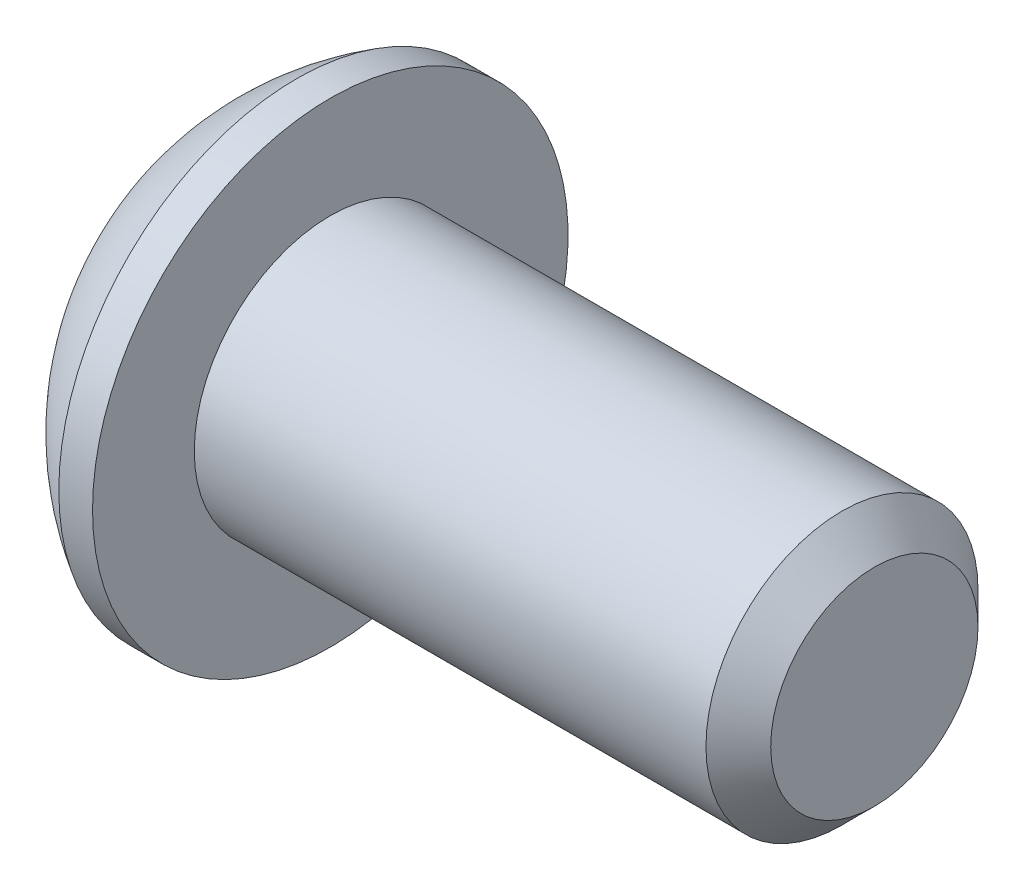
ISO-10303-21;
HEADER;
FILE_DESCRIPTION(('STEP AP214'),'2;1');
FILE_NAME('part.step','',(''),(''),'','','');
FILE_SCHEMA(('AUTOMOTIVE_DESIGN { 1 0 10303 214 1 1 1 1 }'));
ENDSEC;
DATA;
#1=APPLICATION_CONTEXT('core data for automotive mechanical design processes');
#2=APPLICATION_PROTOCOL_DEFINITION('international standard','automotive_design',2000,#1);
#3=PRODUCT_CONTEXT('',#1,'mechanical');
#4=PRODUCT('Part','Part','',(#3));
#5=PRODUCT_RELATED_PRODUCT_CATEGORY('part','',(#4));
#6=PRODUCT_DEFINITION_FORMATION('','',#4);
#7=PRODUCT_DEFINITION_CONTEXT('part definition',#1,'design');
#8=PRODUCT_DEFINITION('design','',#6,#7);
#9=PRODUCT_DEFINITION_SHAPE('','',#8);
#10=(LENGTH_UNIT() NAMED_UNIT(*) SI_UNIT(.MILLI.,.METRE.));
#11=(NAMED_UNIT(*) PLANE_ANGLE_UNIT() SI_UNIT($,.RADIAN.));
#12=(NAMED_UNIT(*) SI_UNIT($,.STERADIAN.) SOLID_ANGLE_UNIT());
#13=UNCERTAINTY_MEASURE_WITH_UNIT(LENGTH_MEASURE(1.E-05),#10,'distance_accuracy_value','');
#14=(GEOMETRIC_REPRESENTATION_CONTEXT(3) GLOBAL_UNCERTAINTY_ASSIGNED_CONTEXT((#13)) GLOBAL_UNIT_ASSIGNED_CONTEXT((#10,
#11,#12)) REPRESENTATION_CONTEXT('',''));
#15=CARTESIAN_POINT('',(0.,0.,0.));
#16=DIRECTION('',(0.,0.,1.));
#17=DIRECTION('',(1.,0.,0.));
#18=AXIS2_PLACEMENT_3D('',#15,#16,#17);
#19=CARTESIAN_POINT('',(0.,0.,0.));
#20=DIRECTION('',(-1.,0.,0.));
#21=DIRECTION('',(0.,0.,1.));
#22=AXIS2_PLACEMENT_3D('',#19,#20,#21);
#23=PLANE('',#22);
#24=CARTESIAN_POINT('',(0.,0.,0.));
#25=DIRECTION('',(-1.,0.,0.));
#26=DIRECTION('',(0.,0.,1.));
#27=AXIS2_PLACEMENT_3D('',#24,#25,#26);
#28=CIRCLE('',#27,2.77495);
#29=CARTESIAN_POINT('',(0.,0.,2.77495));
#30=VERTEX_POINT('',#29);
#31=EDGE_CURVE('E11',#30,#30,#28,.T.);
#32=ORIENTED_EDGE('',*,*,#31,.T.);
#33=EDGE_LOOP('',(#32));
#34=FACE_BOUND('',#33,.T.);
#35=DIRECTION('',(0.,-1.,0.));
#36=VECTOR('',#35,1.);
#37=CARTESIAN_POINT('',(0.,-1.14384635331848,1.9812));
#38=LINE('',#37,#36);
#39=CARTESIAN_POINT('',(0.,1.14384635331849,1.9812));
#40=VERTEX_POINT('',#39);
#41=CARTESIAN_POINT('',(0.,-1.14384635331848,1.9812));
#42=VERTEX_POINT('',#41);
#43=EDGE_CURVE('E48',#40,#42,#38,.T.);
#44=ORIENTED_EDGE('',*,*,#43,.T.);
#45=DIRECTION('',(0.,-0.5,-0.866025403784439));
#46=VECTOR('',#45,1.);
#47=CARTESIAN_POINT('',(0.,-2.28769270663697,0.));
#48=LINE('',#47,#46);
#49=CARTESIAN_POINT('',(0.,-2.28769270663697,0.));
#50=VERTEX_POINT('',#49);
#51=EDGE_CURVE('E105',#42,#50,#48,.T.);
#52=ORIENTED_EDGE('',*,*,#51,.T.);
#53=DIRECTION('',(0.,0.5,-0.866025403784439));
#54=VECTOR('',#53,1.);
#55=CARTESIAN_POINT('',(0.,-1.14384635331848,-1.9812));
#56=LINE('',#55,#54);
#57=CARTESIAN_POINT('',(0.,-1.14384635331848,-1.9812));
#58=VERTEX_POINT('',#57);
#59=EDGE_CURVE('E107',#50,#58,#56,.T.);
#60=ORIENTED_EDGE('',*,*,#59,.T.);
#61=DIRECTION('',(0.,1.,0.));
#62=VECTOR('',#61,1.);
#63=CARTESIAN_POINT('',(0.,1.14384635331849,-1.9812));
#64=LINE('',#63,#62);
#65=CARTESIAN_POINT('',(0.,1.14384635331849,-1.9812));
#66=VERTEX_POINT('',#65);
#67=EDGE_CURVE('E122',#58,#66,#64,.T.);
#68=ORIENTED_EDGE('',*,*,#67,.T.);
#69=DIRECTION('',(0.,0.5,0.866025403784439));
#70=VECTOR('',#69,1.);
#71=CARTESIAN_POINT('',(0.,2.28769270663697,0.));
#72=LINE('',#71,#70);
#73=CARTESIAN_POINT('',(0.,2.28769270663697,0.));
#74=VERTEX_POINT('',#73);
#75=EDGE_CURVE('E381',#66,#74,#72,.T.);
#76=ORIENTED_EDGE('',*,*,#75,.T.);
#77=DIRECTION('',(0.,-0.5,0.866025403784439));
#78=VECTOR('',#77,1.);
#79=CARTESIAN_POINT('',(0.,1.14384635331849,1.9812));
#80=LINE('',#79,#78);
#81=EDGE_CURVE('E382',#74,#40,#80,.T.);
#82=ORIENTED_EDGE('',*,*,#81,.T.);
#83=EDGE_LOOP('',(#44,#52,#60,#68,#76,#82));
#84=FACE_BOUND('',#83,.T.);
#85=ADVANCED_FACE('F34',(#34,#84),#23,.T.);
#86=CARTESIAN_POINT('',(5.78512506188119,0.,0.));
#87=DIRECTION('',(-1.,0.,0.));
#88=DIRECTION('',(0.,1.,0.));
#89=AXIS2_PLACEMENT_3D('',#86,#87,#88);
#90=SPHERICAL_SURFACE('',#89,6.41623094067739);
#91=CARTESIAN_POINT('',(2.5654,0.,0.));
#92=DIRECTION('',(-1.,0.,0.));
#93=DIRECTION('',(0.,0.,1.));
#94=AXIS2_PLACEMENT_3D('',#91,#92,#93);
#95=CIRCLE('',#94,5.5499);
#96=CARTESIAN_POINT('',(2.5654,0.,5.5499));
#97=VERTEX_POINT('',#96);
#98=EDGE_CURVE('E41',#97,#97,#95,.T.);
#99=ORIENTED_EDGE('',*,*,#98,.T.);
#100=EDGE_LOOP('',(#99));
#101=FACE_BOUND('',#100,.T.);
#102=ORIENTED_EDGE('',*,*,#31,.F.);
#103=EDGE_LOOP('',(#102));
#104=FACE_BOUND('',#103,.T.);
#105=ADVANCED_FACE('F155',(#101,#104),#90,.T.);
#106=CARTESIAN_POINT('',(0.,0.,0.));
#107=DIRECTION('',(-1.,0.,0.));
#108=DIRECTION('',(0.,0.,1.));
#109=AXIS2_PLACEMENT_3D('',#106,#107,#108);
#110=CYLINDRICAL_SURFACE('',#109,5.5499);
#111=ORIENTED_EDGE('',*,*,#98,.F.);
#112=EDGE_LOOP('',(#111));
#113=FACE_BOUND('',#112,.T.);
#114=CARTESIAN_POINT('',(3.3528,0.,0.));
#115=DIRECTION('',(-1.,0.,0.));
#116=DIRECTION('',(0.,0.,1.));
#117=AXIS2_PLACEMENT_3D('',#114,#115,#116);
#118=CIRCLE('',#117,5.5499);
#119=CARTESIAN_POINT('',(3.3528,0.,5.5499));
#120=VERTEX_POINT('',#119);
#121=EDGE_CURVE('E150',#120,#120,#118,.T.);
#122=ORIENTED_EDGE('',*,*,#121,.T.);
#123=EDGE_LOOP('',(#122));
#124=FACE_BOUND('',#123,.T.);
#125=ADVANCED_FACE('F158',(#113,#124),#110,.T.);
#126=CARTESIAN_POINT('',(3.3528,3.175,0.));
#127=DIRECTION('',(-1.,0.,0.));
#128=DIRECTION('',(0.,0.,1.));
#129=AXIS2_PLACEMENT_3D('',#126,#127,#128);
#130=PLANE('',#129);
#131=ORIENTED_EDGE('',*,*,#121,.F.);
#132=EDGE_LOOP('',(#131));
#133=FACE_BOUND('',#132,.T.);
#134=CARTESIAN_POINT('',(3.3528,0.,0.));
#135=DIRECTION('',(-1.,0.,0.));
#136=DIRECTION('',(0.,0.,1.));
#137=AXIS2_PLACEMENT_3D('',#134,#135,#136);
#138=CIRCLE('',#137,3.175);
#139=CARTESIAN_POINT('',(3.3528,0.,3.175));
#140=VERTEX_POINT('',#139);
#141=EDGE_CURVE('E147',#140,#140,#138,.T.);
#142=ORIENTED_EDGE('',*,*,#141,.T.);
#143=EDGE_LOOP('',(#142));
#144=FACE_BOUND('',#143,.T.);
#145=ADVANCED_FACE('F161',(#133,#144),#130,.F.);
#146=CARTESIAN_POINT('',(0.,0.,0.));
#147=DIRECTION('',(-1.,0.,0.));
#148=DIRECTION('',(0.,0.,1.));
#149=AXIS2_PLACEMENT_3D('',#146,#147,#148);
#150=CYLINDRICAL_SURFACE('',#149,3.175);
#151=ORIENTED_EDGE('',*,*,#141,.F.);
#152=EDGE_LOOP('',(#151));
#153=FACE_BOUND('',#152,.T.);
#154=CARTESIAN_POINT('',(15.29715,0.,0.));
#155=DIRECTION('',(-1.,0.,0.));
#156=DIRECTION('',(0.,0.,1.));
#157=AXIS2_PLACEMENT_3D('',#154,#155,#156);
#158=CIRCLE('',#157,3.175);
#159=CARTESIAN_POINT('',(15.29715,0.,3.175));
#160=VERTEX_POINT('',#159);
#161=EDGE_CURVE('E144',#160,#160,#158,.T.);
#162=ORIENTED_EDGE('',*,*,#161,.T.);
#163=EDGE_LOOP('',(#162));
#164=FACE_BOUND('',#163,.T.);
#165=ADVANCED_FACE('F167',(#153,#164),#150,.T.);
#166=CARTESIAN_POINT('',(16.0528,0.,0.));
#167=DIRECTION('',(-1.,0.,0.));
#168=DIRECTION('',(0.,0.,1.));
#169=AXIS2_PLACEMENT_3D('',#166,#167,#168);
#170=CONICAL_SURFACE('',#169,2.41935,0.785398163397447);
#171=ORIENTED_EDGE('',*,*,#161,.F.);
#172=EDGE_LOOP('',(#171));
#173=FACE_BOUND('',#172,.T.);
#174=CARTESIAN_POINT('',(16.0528,0.,0.));
#175=DIRECTION('',(-1.,0.,0.));
#176=DIRECTION('',(0.,0.,1.));
#177=AXIS2_PLACEMENT_3D('',#174,#175,#176);
#178=CIRCLE('',#177,2.41935);
#179=CARTESIAN_POINT('',(16.0528,0.,2.41935));
#180=VERTEX_POINT('',#179);
#181=EDGE_CURVE('E140',#180,#180,#178,.T.);
#182=ORIENTED_EDGE('',*,*,#181,.T.);
#183=EDGE_LOOP('',(#182));
#184=FACE_BOUND('',#183,.T.);
#185=ADVANCED_FACE('F173',(#173,#184),#170,.T.);
#186=CARTESIAN_POINT('',(16.0528,0.,0.));
#187=DIRECTION('',(-1.,0.,0.));
#188=DIRECTION('',(0.,0.,1.));
#189=AXIS2_PLACEMENT_3D('',#186,#187,#188);
#190=PLANE('',#189);
#191=ORIENTED_EDGE('',*,*,#181,.F.);
#192=EDGE_LOOP('',(#191));
#193=FACE_BOUND('',#192,.T.);
#194=ADVANCED_FACE('F179',(#193),#190,.F.);
#195=CARTESIAN_POINT('',(2.2098,-2.28769270663697,0.));
#196=DIRECTION('',(0.,0.866025403784439,-0.5));
#197=DIRECTION('',(0.,0.5,0.866025403784439));
#198=AXIS2_PLACEMENT_3D('',#195,#196,#197);
#199=PLANE('',#198);
#200=DIRECTION('',(0.,-0.5,-0.866025403784439));
#201=VECTOR('',#200,1.);
#202=CARTESIAN_POINT('',(2.2098,-2.28769270663697,0.));
#203=LINE('',#202,#201);
#204=CARTESIAN_POINT('',(2.2098,-1.14384635331848,1.9812));
#205=VERTEX_POINT('',#204);
#206=CARTESIAN_POINT('',(2.2098,-1.71576952997773,0.990599999999998));
#207=VERTEX_POINT('',#206);
#208=EDGE_CURVE('E388',#205,#207,#203,.T.);
#209=ORIENTED_EDGE('',*,*,#208,.T.);
#210=CARTESIAN_POINT('',(2.2098,-2.28769270663697,0.));
#211=VERTEX_POINT('',#210);
#212=EDGE_CURVE('E127',#207,#211,#203,.T.);
#213=ORIENTED_EDGE('',*,*,#212,.T.);
#214=DIRECTION('',(-1.,0.,0.));
#215=VECTOR('',#214,1.);
#216=CARTESIAN_POINT('',(2.2098,-2.28769270663697,0.));
#217=LINE('',#216,#215);
#218=EDGE_CURVE('E118',#211,#50,#217,.T.);
#219=ORIENTED_EDGE('',*,*,#218,.T.);
#220=ORIENTED_EDGE('',*,*,#51,.F.);
#221=DIRECTION('',(-1.,0.,0.));
#222=VECTOR('',#221,1.);
#223=CARTESIAN_POINT('',(2.2098,-1.14384635331848,1.9812));
#224=LINE('',#223,#222);
#225=EDGE_CURVE('E369',#205,#42,#224,.T.);
#226=ORIENTED_EDGE('',*,*,#225,.F.);
#227=EDGE_LOOP('',(#209,#213,#219,#220,#226));
#228=FACE_BOUND('',#227,.T.);
#229=ADVANCED_FACE('F125',(#228),#199,.T.);
#230=CARTESIAN_POINT('',(2.2098,-1.14384635331848,-1.9812));
#231=DIRECTION('',(0.,0.866025403784439,0.5));
#232=DIRECTION('',(0.,-0.5,0.866025403784439));
#233=AXIS2_PLACEMENT_3D('',#230,#231,#232);
#234=PLANE('',#233);
#235=DIRECTION('',(0.,0.5,-0.866025403784439));
#236=VECTOR('',#235,1.);
#237=CARTESIAN_POINT('',(2.2098,-1.14384635331848,-1.9812));
#238=LINE('',#237,#236);
#239=CARTESIAN_POINT('',(2.2098,-1.71576952997773,-0.990599999999998));
#240=VERTEX_POINT('',#239);
#241=EDGE_CURVE('E391',#211,#240,#238,.T.);
#242=ORIENTED_EDGE('',*,*,#241,.T.);
#243=CARTESIAN_POINT('',(2.2098,-1.14384635331848,-1.9812));
#244=VERTEX_POINT('',#243);
#245=EDGE_CURVE('E390',#240,#244,#238,.T.);
#246=ORIENTED_EDGE('',*,*,#245,.T.);
#247=DIRECTION('',(-1.,0.,0.));
#248=VECTOR('',#247,1.);
#249=CARTESIAN_POINT('',(2.2098,-1.14384635331848,-1.9812));
#250=LINE('',#249,#248);
#251=EDGE_CURVE('E120',#244,#58,#250,.T.);
#252=ORIENTED_EDGE('',*,*,#251,.T.);
#253=ORIENTED_EDGE('',*,*,#59,.F.);
#254=ORIENTED_EDGE('',*,*,#218,.F.);
#255=EDGE_LOOP('',(#242,#246,#252,#253,#254));
#256=FACE_BOUND('',#255,.T.);
#257=ADVANCED_FACE('F117',(#256),#234,.T.);
#258=CARTESIAN_POINT('',(2.2098,1.14384635331849,-1.9812));
#259=DIRECTION('',(0.,0.,1.));
#260=DIRECTION('',(1.,0.,0.));
#261=AXIS2_PLACEMENT_3D('',#258,#259,#260);
#262=PLANE('',#261);
#263=DIRECTION('',(0.,1.,0.));
#264=VECTOR('',#263,1.);
#265=CARTESIAN_POINT('',(2.2098,1.14384635331849,-1.9812));
#266=LINE('',#265,#264);
#267=CARTESIAN_POINT('',(2.2098,0.,-1.9812));
#268=VERTEX_POINT('',#267);
#269=EDGE_CURVE('E392',#244,#268,#266,.T.);
#270=ORIENTED_EDGE('',*,*,#269,.T.);
#271=CARTESIAN_POINT('',(2.2098,1.14384635331849,-1.9812));
#272=VERTEX_POINT('',#271);
#273=EDGE_CURVE('E378',#268,#272,#266,.T.);
#274=ORIENTED_EDGE('',*,*,#273,.T.);
#275=DIRECTION('',(-1.,0.,0.));
#276=VECTOR('',#275,1.);
#277=CARTESIAN_POINT('',(2.2098,1.14384635331849,-1.9812));
#278=LINE('',#277,#276);
#279=EDGE_CURVE('E135',#272,#66,#278,.T.);
#280=ORIENTED_EDGE('',*,*,#279,.T.);
#281=ORIENTED_EDGE('',*,*,#67,.F.);
#282=ORIENTED_EDGE('',*,*,#251,.F.);
#283=EDGE_LOOP('',(#270,#274,#280,#281,#282));
#284=FACE_BOUND('',#283,.T.);
#285=ADVANCED_FACE('F241',(#284),#262,.T.);
#286=CARTESIAN_POINT('',(2.2098,2.28769270663697,0.));
#287=DIRECTION('',(0.,-0.866025403784439,0.5));
#288=DIRECTION('',(0.,-0.5,-0.866025403784439));
#289=AXIS2_PLACEMENT_3D('',#286,#287,#288);
#290=PLANE('',#289);
#291=DIRECTION('',(0.,0.5,0.866025403784439));
#292=VECTOR('',#291,1.);
#293=CARTESIAN_POINT('',(2.2098,2.28769270663697,0.));
#294=LINE('',#293,#292);
#295=CARTESIAN_POINT('',(2.2098,1.71576952997773,-0.9906));
#296=VERTEX_POINT('',#295);
#297=EDGE_CURVE('E356',#272,#296,#294,.T.);
#298=ORIENTED_EDGE('',*,*,#297,.T.);
#299=CARTESIAN_POINT('',(2.2098,2.28769270663697,0.));
#300=VERTEX_POINT('',#299);
#301=EDGE_CURVE('E393',#296,#300,#294,.T.);
#302=ORIENTED_EDGE('',*,*,#301,.T.);
#303=DIRECTION('',(-1.,0.,0.));
#304=VECTOR('',#303,1.);
#305=CARTESIAN_POINT('',(2.2098,2.28769270663697,0.));
#306=LINE('',#305,#304);
#307=EDGE_CURVE('E362',#300,#74,#306,.T.);
#308=ORIENTED_EDGE('',*,*,#307,.T.);
#309=ORIENTED_EDGE('',*,*,#75,.F.);
#310=ORIENTED_EDGE('',*,*,#279,.F.);
#311=EDGE_LOOP('',(#298,#302,#308,#309,#310));
#312=FACE_BOUND('',#311,.T.);
#313=ADVANCED_FACE('F250',(#312),#290,.T.);
#314=CARTESIAN_POINT('',(2.2098,1.14384635331849,1.9812));
#315=DIRECTION('',(0.,-0.866025403784439,-0.5));
#316=DIRECTION('',(0.,0.5,-0.866025403784439));
#317=AXIS2_PLACEMENT_3D('',#314,#315,#316);
#318=PLANE('',#317);
#319=DIRECTION('',(0.,-0.5,0.866025403784439));
#320=VECTOR('',#319,1.);
#321=CARTESIAN_POINT('',(2.2098,1.14384635331849,1.9812));
#322=LINE('',#321,#320);
#323=CARTESIAN_POINT('',(2.2098,1.71576952997773,0.9906));
#324=VERTEX_POINT('',#323);
#325=EDGE_CURVE('E355',#300,#324,#322,.T.);
#326=ORIENTED_EDGE('',*,*,#325,.T.);
#327=CARTESIAN_POINT('',(2.2098,1.14384635331849,1.9812));
#328=VERTEX_POINT('',#327);
#329=EDGE_CURVE('E352',#324,#328,#322,.T.);
#330=ORIENTED_EDGE('',*,*,#329,.T.);
#331=DIRECTION('',(-1.,0.,0.));
#332=VECTOR('',#331,1.);
#333=CARTESIAN_POINT('',(2.2098,1.14384635331849,1.9812));
#334=LINE('',#333,#332);
#335=EDGE_CURVE('E371',#328,#40,#334,.T.);
#336=ORIENTED_EDGE('',*,*,#335,.T.);
#337=ORIENTED_EDGE('',*,*,#81,.F.);
#338=ORIENTED_EDGE('',*,*,#307,.F.);
#339=EDGE_LOOP('',(#326,#330,#336,#337,#338));
#340=FACE_BOUND('',#339,.T.);
#341=ADVANCED_FACE('F260',(#340),#318,.T.);
#342=CARTESIAN_POINT('',(2.2098,-1.14384635331848,1.9812));
#343=DIRECTION('',(0.,0.,-1.));
#344=DIRECTION('',(-1.,0.,0.));
#345=AXIS2_PLACEMENT_3D('',#342,#343,#344);
#346=PLANE('',#345);
#347=DIRECTION('',(0.,-1.,0.));
#348=VECTOR('',#347,1.);
#349=CARTESIAN_POINT('',(2.2098,-1.14384635331848,1.9812));
#350=LINE('',#349,#348);
#351=CARTESIAN_POINT('',(2.2098,0.,1.9812));
#352=VERTEX_POINT('',#351);
#353=EDGE_CURVE('E56',#328,#352,#350,.T.);
#354=ORIENTED_EDGE('',*,*,#353,.T.);
#355=EDGE_CURVE('E364',#352,#205,#350,.T.);
#356=ORIENTED_EDGE('',*,*,#355,.T.);
#357=ORIENTED_EDGE('',*,*,#225,.T.);
#358=ORIENTED_EDGE('',*,*,#43,.F.);
#359=ORIENTED_EDGE('',*,*,#335,.F.);
#360=EDGE_LOOP('',(#354,#356,#357,#358,#359));
#361=FACE_BOUND('',#360,.T.);
#362=ADVANCED_FACE('F270',(#361),#346,.T.);
#363=CARTESIAN_POINT('',(2.2098,-1.14384635331848,1.9812));
#364=DIRECTION('',(-1.,0.,0.));
#365=DIRECTION('',(0.,0.,1.));
#366=AXIS2_PLACEMENT_3D('',#363,#364,#365);
#367=PLANE('',#366);
#368=ORIENTED_EDGE('',*,*,#353,.F.);
#369=ORIENTED_EDGE('',*,*,#329,.F.);
#370=CARTESIAN_POINT('',(2.2098,0.,0.));
#371=DIRECTION('',(-1.,0.,0.));
#372=DIRECTION('',(0.,0.,1.));
#373=AXIS2_PLACEMENT_3D('',#370,#371,#372);
#374=CIRCLE('',#373,1.9812);
#375=EDGE_CURVE('E134',#352,#324,#374,.T.);
#376=ORIENTED_EDGE('',*,*,#375,.F.);
#377=EDGE_LOOP('',(#368,#369,#376));
#378=FACE_BOUND('',#377,.T.);
#379=ADVANCED_FACE('F280',(#378),#367,.T.);
#380=ORIENTED_EDGE('',*,*,#325,.F.);
#381=ORIENTED_EDGE('',*,*,#301,.F.);
#382=EDGE_CURVE('E141',#324,#296,#374,.T.);
#383=ORIENTED_EDGE('',*,*,#382,.F.);
#384=EDGE_LOOP('',(#380,#381,#383));
#385=FACE_BOUND('',#384,.T.);
#386=ADVANCED_FACE('F289',(#385),#367,.T.);
#387=ORIENTED_EDGE('',*,*,#297,.F.);
#388=ORIENTED_EDGE('',*,*,#273,.F.);
#389=EDGE_CURVE('E395',#296,#268,#374,.T.);
#390=ORIENTED_EDGE('',*,*,#389,.F.);
#391=EDGE_LOOP('',(#387,#388,#390));
#392=FACE_BOUND('',#391,.T.);
#393=ADVANCED_FACE('F300',(#392),#367,.T.);
#394=ORIENTED_EDGE('',*,*,#269,.F.);
#395=ORIENTED_EDGE('',*,*,#245,.F.);
#396=EDGE_CURVE('E397',#268,#240,#374,.T.);
#397=ORIENTED_EDGE('',*,*,#396,.F.);
#398=EDGE_LOOP('',(#394,#395,#397));
#399=FACE_BOUND('',#398,.T.);
#400=ADVANCED_FACE('F309',(#399),#367,.T.);
#401=ORIENTED_EDGE('',*,*,#241,.F.);
#402=ORIENTED_EDGE('',*,*,#212,.F.);
#403=EDGE_CURVE('E132',#240,#207,#374,.T.);
#404=ORIENTED_EDGE('',*,*,#403,.F.);
#405=EDGE_LOOP('',(#401,#402,#404));
#406=FACE_BOUND('',#405,.T.);
#407=ADVANCED_FACE('F318',(#406),#367,.T.);
#408=ORIENTED_EDGE('',*,*,#208,.F.);
#409=ORIENTED_EDGE('',*,*,#355,.F.);
#410=EDGE_CURVE('E129',#207,#352,#374,.T.);
#411=ORIENTED_EDGE('',*,*,#410,.F.);
#412=EDGE_LOOP('',(#408,#409,#411));
#413=FACE_BOUND('',#412,.T.);
#414=ADVANCED_FACE('F292',(#413),#367,.T.);
#415=CARTESIAN_POINT('',(3.3536463533185,0.,0.));
#416=DIRECTION('',(-1.,0.,0.));
#417=DIRECTION('',(0.,0.,1.));
#418=AXIS2_PLACEMENT_3D('',#415,#416,#417);
#419=CONICAL_SURFACE('',#418,0.,1.04719755119659);
#420=ORIENTED_EDGE('',*,*,#375,.T.);
#421=ORIENTED_EDGE('',*,*,#382,.T.);
#422=ORIENTED_EDGE('',*,*,#389,.T.);
#423=ORIENTED_EDGE('',*,*,#396,.T.);
#424=ORIENTED_EDGE('',*,*,#403,.T.);
#425=ORIENTED_EDGE('',*,*,#410,.T.);
#426=EDGE_LOOP('',(#420,#421,#422,#423,#424,#425));
#427=FACE_BOUND('',#426,.T.);
#428=CARTESIAN_POINT('',(3.3536463533185,0.,0.));
#429=VERTEX_POINT('',#428);
#430=VERTEX_LOOP('',#429);
#431=FACE_BOUND('',#430,.T.);
#432=ADVANCED_FACE('F335',(#427,#431),#419,.F.);
#433=CLOSED_SHELL('',(#85,#105,#125,#145,#165,#185,#194,#229,#257,#285,#313,#341,#362,#379,#386,
#393,#400,#407,#414,#432));
#434=MANIFOLD_SOLID_BREP('B2',#433);
#435=ADVANCED_BREP_SHAPE_REPRESENTATION('',(#18,#434),#14);
#436=SHAPE_DEFINITION_REPRESENTATION(#9,#435);
ENDSEC;
END-ISO-10303-21;
